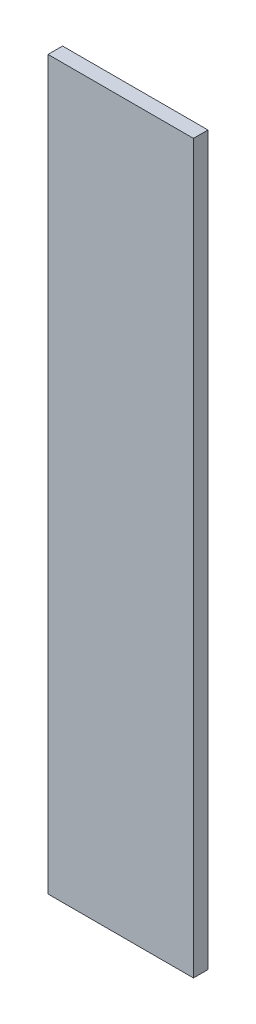
ISO-10303-21;
HEADER;
FILE_DESCRIPTION(('STEP AP214'),'2;1');
FILE_NAME('part.step','',(''),(''),'','','');
FILE_SCHEMA(('AUTOMOTIVE_DESIGN { 1 0 10303 214 1 1 1 1 }'));
ENDSEC;
DATA;
#1=APPLICATION_CONTEXT('core data for automotive mechanical design processes');
#2=APPLICATION_PROTOCOL_DEFINITION('international standard','automotive_design',2000,#1);
#3=PRODUCT_CONTEXT('',#1,'mechanical');
#4=PRODUCT('Part','Part','',(#3));
#5=PRODUCT_RELATED_PRODUCT_CATEGORY('part','',(#4));
#6=PRODUCT_DEFINITION_FORMATION('','',#4);
#7=PRODUCT_DEFINITION_CONTEXT('part definition',#1,'design');
#8=PRODUCT_DEFINITION('design','',#6,#7);
#9=PRODUCT_DEFINITION_SHAPE('','',#8);
#10=(LENGTH_UNIT() NAMED_UNIT(*) SI_UNIT(.MILLI.,.METRE.));
#11=(NAMED_UNIT(*) PLANE_ANGLE_UNIT() SI_UNIT($,.RADIAN.));
#12=(NAMED_UNIT(*) SI_UNIT($,.STERADIAN.) SOLID_ANGLE_UNIT());
#13=UNCERTAINTY_MEASURE_WITH_UNIT(LENGTH_MEASURE(1.E-05),#10,'distance_accuracy_value','');
#14=(GEOMETRIC_REPRESENTATION_CONTEXT(3) GLOBAL_UNCERTAINTY_ASSIGNED_CONTEXT((#13)) GLOBAL_UNIT_ASSIGNED_CONTEXT((#10,
#11,#12)) REPRESENTATION_CONTEXT('',''));
#15=CARTESIAN_POINT('',(0.,0.,0.));
#16=DIRECTION('',(0.,0.,1.));
#17=DIRECTION('',(1.,0.,0.));
#18=AXIS2_PLACEMENT_3D('',#15,#16,#17);
#19=CARTESIAN_POINT('',(0.,0.,20.));
#20=DIRECTION('',(1.,0.,0.));
#21=DIRECTION('',(0.,0.,-1.));
#22=AXIS2_PLACEMENT_3D('',#19,#20,#21);
#23=PLANE('',#22);
#24=DIRECTION('',(0.,-1.,0.));
#25=VECTOR('',#24,1.);
#26=CARTESIAN_POINT('',(0.,0.,0.));
#27=LINE('',#26,#25);
#28=CARTESIAN_POINT('',(0.,1000.,0.));
#29=VERTEX_POINT('',#28);
#30=CARTESIAN_POINT('',(0.,0.,0.));
#31=VERTEX_POINT('',#30);
#32=EDGE_CURVE('E102',#29,#31,#27,.T.);
#33=ORIENTED_EDGE('',*,*,#32,.T.);
#34=DIRECTION('',(0.,0.,-1.));
#35=VECTOR('',#34,1.);
#36=CARTESIAN_POINT('',(0.,0.,20.));
#37=LINE('',#36,#35);
#38=CARTESIAN_POINT('',(0.,0.,20.));
#39=VERTEX_POINT('',#38);
#40=EDGE_CURVE('E11',#39,#31,#37,.T.);
#41=ORIENTED_EDGE('',*,*,#40,.F.);
#42=DIRECTION('',(0.,-1.,0.));
#43=VECTOR('',#42,1.);
#44=CARTESIAN_POINT('',(0.,0.,20.));
#45=LINE('',#44,#43);
#46=CARTESIAN_POINT('',(0.,1000.,20.));
#47=VERTEX_POINT('',#46);
#48=EDGE_CURVE('E90',#47,#39,#45,.T.);
#49=ORIENTED_EDGE('',*,*,#48,.F.);
#50=DIRECTION('',(0.,0.,-1.));
#51=VECTOR('',#50,1.);
#52=CARTESIAN_POINT('',(0.,1000.,20.));
#53=LINE('',#52,#51);
#54=EDGE_CURVE('E98',#47,#29,#53,.T.);
#55=ORIENTED_EDGE('',*,*,#54,.T.);
#56=EDGE_LOOP('',(#33,#41,#49,#55));
#57=FACE_BOUND('',#56,.T.);
#58=ADVANCED_FACE('F39',(#57),#23,.F.);
#59=CARTESIAN_POINT('',(0.,0.,20.));
#60=DIRECTION('',(0.,1.,0.));
#61=DIRECTION('',(0.,0.,1.));
#62=AXIS2_PLACEMENT_3D('',#59,#60,#61);
#63=PLANE('',#62);
#64=DIRECTION('',(1.,0.,0.));
#65=VECTOR('',#64,1.);
#66=CARTESIAN_POINT('',(0.,0.,0.));
#67=LINE('',#66,#65);
#68=CARTESIAN_POINT('',(200.,0.,0.));
#69=VERTEX_POINT('',#68);
#70=EDGE_CURVE('E94',#31,#69,#67,.T.);
#71=ORIENTED_EDGE('',*,*,#70,.T.);
#72=DIRECTION('',(0.,0.,-1.));
#73=VECTOR('',#72,1.);
#74=CARTESIAN_POINT('',(200.,0.,20.));
#75=LINE('',#74,#73);
#76=CARTESIAN_POINT('',(200.,0.,20.));
#77=VERTEX_POINT('',#76);
#78=EDGE_CURVE('E47',#77,#69,#75,.T.);
#79=ORIENTED_EDGE('',*,*,#78,.F.);
#80=DIRECTION('',(1.,0.,0.));
#81=VECTOR('',#80,1.);
#82=CARTESIAN_POINT('',(0.,0.,20.));
#83=LINE('',#82,#81);
#84=EDGE_CURVE('E85',#39,#77,#83,.T.);
#85=ORIENTED_EDGE('',*,*,#84,.F.);
#86=ORIENTED_EDGE('',*,*,#40,.T.);
#87=EDGE_LOOP('',(#71,#79,#85,#86));
#88=FACE_BOUND('',#87,.T.);
#89=ADVANCED_FACE('F93',(#88),#63,.F.);
#90=CARTESIAN_POINT('',(200.,0.,20.));
#91=DIRECTION('',(-1.,0.,0.));
#92=DIRECTION('',(0.,0.,1.));
#93=AXIS2_PLACEMENT_3D('',#90,#91,#92);
#94=PLANE('',#93);
#95=DIRECTION('',(0.,1.,0.));
#96=VECTOR('',#95,1.);
#97=CARTESIAN_POINT('',(200.,0.,0.));
#98=LINE('',#97,#96);
#99=CARTESIAN_POINT('',(200.,1000.,0.));
#100=VERTEX_POINT('',#99);
#101=EDGE_CURVE('E72',#69,#100,#98,.T.);
#102=ORIENTED_EDGE('',*,*,#101,.T.);
#103=DIRECTION('',(0.,0.,-1.));
#104=VECTOR('',#103,1.);
#105=CARTESIAN_POINT('',(200.,1000.,20.));
#106=LINE('',#105,#104);
#107=CARTESIAN_POINT('',(200.,1000.,20.));
#108=VERTEX_POINT('',#107);
#109=EDGE_CURVE('E95',#108,#100,#106,.T.);
#110=ORIENTED_EDGE('',*,*,#109,.F.);
#111=DIRECTION('',(0.,1.,0.));
#112=VECTOR('',#111,1.);
#113=CARTESIAN_POINT('',(200.,0.,20.));
#114=LINE('',#113,#112);
#115=EDGE_CURVE('E88',#77,#108,#114,.T.);
#116=ORIENTED_EDGE('',*,*,#115,.F.);
#117=ORIENTED_EDGE('',*,*,#78,.T.);
#118=EDGE_LOOP('',(#102,#110,#116,#117));
#119=FACE_BOUND('',#118,.T.);
#120=ADVANCED_FACE('F96',(#119),#94,.F.);
#121=CARTESIAN_POINT('',(0.,1000.,20.));
#122=DIRECTION('',(0.,-1.,0.));
#123=DIRECTION('',(0.,0.,-1.));
#124=AXIS2_PLACEMENT_3D('',#121,#122,#123);
#125=PLANE('',#124);
#126=DIRECTION('',(-1.,0.,0.));
#127=VECTOR('',#126,1.);
#128=CARTESIAN_POINT('',(0.,1000.,0.));
#129=LINE('',#128,#127);
#130=EDGE_CURVE('E78',#100,#29,#129,.T.);
#131=ORIENTED_EDGE('',*,*,#130,.T.);
#132=ORIENTED_EDGE('',*,*,#54,.F.);
#133=DIRECTION('',(-1.,0.,0.));
#134=VECTOR('',#133,1.);
#135=CARTESIAN_POINT('',(0.,1000.,20.));
#136=LINE('',#135,#134);
#137=EDGE_CURVE('E55',#108,#47,#136,.T.);
#138=ORIENTED_EDGE('',*,*,#137,.F.);
#139=ORIENTED_EDGE('',*,*,#109,.T.);
#140=EDGE_LOOP('',(#131,#132,#138,#139));
#141=FACE_BOUND('',#140,.T.);
#142=ADVANCED_FACE('F109',(#141),#125,.F.);
#143=CARTESIAN_POINT('',(0.,0.,20.));
#144=DIRECTION('',(0.,0.,-1.));
#145=DIRECTION('',(-1.,0.,0.));
#146=AXIS2_PLACEMENT_3D('',#143,#144,#145);
#147=PLANE('',#146);
#148=ORIENTED_EDGE('',*,*,#48,.T.);
#149=ORIENTED_EDGE('',*,*,#84,.T.);
#150=ORIENTED_EDGE('',*,*,#115,.T.);
#151=ORIENTED_EDGE('',*,*,#137,.T.);
#152=EDGE_LOOP('',(#148,#149,#150,#151));
#153=FACE_BOUND('',#152,.T.);
#154=ADVANCED_FACE('F86',(#153),#147,.F.);
#155=CARTESIAN_POINT('',(0.,0.,0.));
#156=DIRECTION('',(0.,0.,-1.));
#157=DIRECTION('',(-1.,0.,0.));
#158=AXIS2_PLACEMENT_3D('',#155,#156,#157);
#159=PLANE('',#158);
#160=ORIENTED_EDGE('',*,*,#32,.F.);
#161=ORIENTED_EDGE('',*,*,#130,.F.);
#162=ORIENTED_EDGE('',*,*,#101,.F.);
#163=ORIENTED_EDGE('',*,*,#70,.F.);
#164=EDGE_LOOP('',(#160,#161,#162,#163));
#165=FACE_BOUND('',#164,.T.);
#166=ADVANCED_FACE('F112',(#165),#159,.T.);
#167=CLOSED_SHELL('',(#58,#89,#120,#142,#154,#166));
#168=MANIFOLD_SOLID_BREP('B2',#167);
#169=ADVANCED_BREP_SHAPE_REPRESENTATION('',(#18,#168),#14);
#170=SHAPE_DEFINITION_REPRESENTATION(#9,#169);
ENDSEC;
END-ISO-10303-21;
